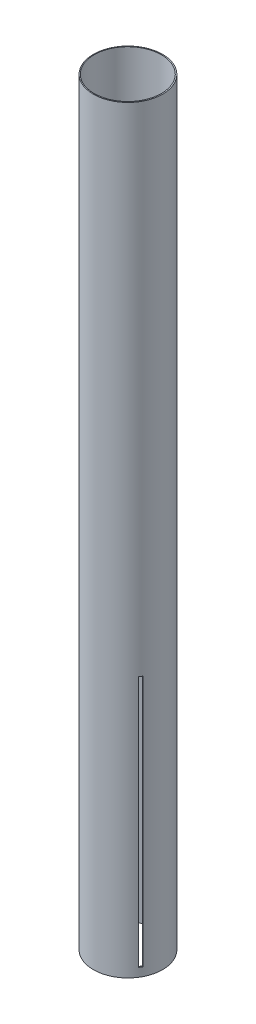
ISO-10303-21;
HEADER;
FILE_DESCRIPTION(('STEP AP214'),'2;1');
FILE_NAME('part.step','',(''),(''),'','','');
FILE_SCHEMA(('AUTOMOTIVE_DESIGN { 1 0 10303 214 1 1 1 1 }'));
ENDSEC;
DATA;
#1=APPLICATION_CONTEXT('core data for automotive mechanical design processes');
#2=APPLICATION_PROTOCOL_DEFINITION('international standard','automotive_design',2000,#1);
#3=PRODUCT_CONTEXT('',#1,'mechanical');
#4=PRODUCT('Part','Part','',(#3));
#5=PRODUCT_RELATED_PRODUCT_CATEGORY('part','',(#4));
#6=PRODUCT_DEFINITION_FORMATION('','',#4);
#7=PRODUCT_DEFINITION_CONTEXT('part definition',#1,'design');
#8=PRODUCT_DEFINITION('design','',#6,#7);
#9=PRODUCT_DEFINITION_SHAPE('','',#8);
#10=(LENGTH_UNIT() NAMED_UNIT(*) SI_UNIT(.MILLI.,.METRE.));
#11=(NAMED_UNIT(*) PLANE_ANGLE_UNIT() SI_UNIT($,.RADIAN.));
#12=(NAMED_UNIT(*) SI_UNIT($,.STERADIAN.) SOLID_ANGLE_UNIT());
#13=UNCERTAINTY_MEASURE_WITH_UNIT(LENGTH_MEASURE(1.E-05),#10,'distance_accuracy_value','');
#14=(GEOMETRIC_REPRESENTATION_CONTEXT(3) GLOBAL_UNCERTAINTY_ASSIGNED_CONTEXT((#13)) GLOBAL_UNIT_ASSIGNED_CONTEXT((#10,
#11,#12)) REPRESENTATION_CONTEXT('',''));
#15=CARTESIAN_POINT('',(0.,0.,0.));
#16=DIRECTION('',(0.,0.,1.));
#17=DIRECTION('',(1.,0.,0.));
#18=AXIS2_PLACEMENT_3D('',#15,#16,#17);
#19=CARTESIAN_POINT('',(0.,1117.6,0.));
#20=DIRECTION('',(0.,1.,0.));
#21=DIRECTION('',(0.,0.,1.));
#22=AXIS2_PLACEMENT_3D('',#19,#20,#21);
#23=PLANE('',#22);
#24=CARTESIAN_POINT('',(0.,1117.6,0.));
#25=DIRECTION('',(0.,1.,0.));
#26=DIRECTION('',(0.,0.,1.));
#27=AXIS2_PLACEMENT_3D('',#24,#25,#26);
#28=CIRCLE('',#27,51.);
#29=CARTESIAN_POINT('',(0.,1117.6,51.));
#30=VERTEX_POINT('',#29);
#31=EDGE_CURVE('E168',#30,#30,#28,.T.);
#32=ORIENTED_EDGE('',*,*,#31,.T.);
#33=EDGE_LOOP('',(#32));
#34=FACE_BOUND('',#33,.T.);
#35=CARTESIAN_POINT('',(-0.342312984914291,1117.6,0.));
#36=DIRECTION('',(0.,1.,0.));
#37=DIRECTION('',(0.,0.,1.));
#38=AXIS2_PLACEMENT_3D('',#35,#36,#37);
#39=CIRCLE('',#38,49.55);
#40=CARTESIAN_POINT('',(-0.342312984914291,1117.6,49.55));
#41=VERTEX_POINT('',#40);
#42=EDGE_CURVE('E172',#41,#41,#39,.T.);
#43=ORIENTED_EDGE('',*,*,#42,.F.);
#44=EDGE_LOOP('',(#43));
#45=FACE_BOUND('',#44,.T.);
#46=ADVANCED_FACE('F33',(#34,#45),#23,.T.);
#47=CARTESIAN_POINT('',(0.,0.,0.));
#48=DIRECTION('',(0.,1.,0.));
#49=DIRECTION('',(0.,0.,1.));
#50=AXIS2_PLACEMENT_3D('',#47,#48,#49);
#51=PLANE('',#50);
#52=CARTESIAN_POINT('',(0.,0.,0.));
#53=DIRECTION('',(0.,1.,0.));
#54=DIRECTION('',(0.,0.,1.));
#55=AXIS2_PLACEMENT_3D('',#52,#53,#54);
#56=CIRCLE('',#55,51.);
#57=CARTESIAN_POINT('',(0.,0.,51.));
#58=VERTEX_POINT('',#57);
#59=EDGE_CURVE('E169',#58,#58,#56,.T.);
#60=ORIENTED_EDGE('',*,*,#59,.F.);
#61=EDGE_LOOP('',(#60));
#62=FACE_BOUND('',#61,.T.);
#63=CARTESIAN_POINT('',(-0.342312984914291,0.,0.));
#64=DIRECTION('',(0.,1.,0.));
#65=DIRECTION('',(0.,0.,1.));
#66=AXIS2_PLACEMENT_3D('',#63,#64,#65);
#67=CIRCLE('',#66,49.55);
#68=CARTESIAN_POINT('',(-0.342312984914291,0.,49.55));
#69=VERTEX_POINT('',#68);
#70=EDGE_CURVE('E175',#69,#69,#67,.T.);
#71=ORIENTED_EDGE('',*,*,#70,.T.);
#72=EDGE_LOOP('',(#71));
#73=FACE_BOUND('',#72,.T.);
#74=ADVANCED_FACE('F239',(#62,#73),#51,.F.);
#75=CARTESIAN_POINT('',(0.,1117.6,0.));
#76=DIRECTION('',(0.,-1.,0.));
#77=DIRECTION('',(0.,0.,-1.));
#78=AXIS2_PLACEMENT_3D('',#75,#76,#77);
#79=CYLINDRICAL_SURFACE('',#78,51.);
#80=CARTESIAN_POINT('',(0.,383.7,0.));
#81=DIRECTION('',(0.,1.,0.));
#82=DIRECTION('',(0.,0.,1.));
#83=AXIS2_PLACEMENT_3D('',#80,#81,#82);
#84=CIRCLE('',#83,51.);
#85=CARTESIAN_POINT('',(-45.3091761029145,383.7,23.4110777384357));
#86=VERTEX_POINT('',#85);
#87=CARTESIAN_POINT('',(-42.9291761029145,383.7,27.5333586604496));
#88=VERTEX_POINT('',#87);
#89=EDGE_CURVE('E204',#86,#88,#84,.T.);
#90=ORIENTED_EDGE('',*,*,#89,.T.);
#91=DIRECTION('',(0.,-1.,0.));
#92=VECTOR('',#91,1.);
#93=CARTESIAN_POINT('',(-42.9291761029144,1117.6,27.5333586604497));
#94=LINE('',#93,#92);
#95=CARTESIAN_POINT('',(-42.9291761029146,12.6999999999999,27.5333586604495));
#96=VERTEX_POINT('',#95);
#97=EDGE_CURVE('E195',#88,#96,#94,.T.);
#98=ORIENTED_EDGE('',*,*,#97,.T.);
#99=CARTESIAN_POINT('',(0.,12.6999999999999,0.));
#100=DIRECTION('',(0.,-1.,0.));
#101=DIRECTION('',(0.,0.,-1.));
#102=AXIS2_PLACEMENT_3D('',#99,#100,#101);
#103=CIRCLE('',#102,51.);
#104=CARTESIAN_POINT('',(-45.3091761029146,12.6999999999999,23.4110777384356));
#105=VERTEX_POINT('',#104);
#106=EDGE_CURVE('E211',#96,#105,#103,.T.);
#107=ORIENTED_EDGE('',*,*,#106,.T.);
#108=DIRECTION('',(0.,-1.,0.));
#109=VECTOR('',#108,1.);
#110=CARTESIAN_POINT('',(-45.3091761029145,1117.6,23.4110777384358));
#111=LINE('',#110,#109);
#112=EDGE_CURVE('E207',#105,#86,#111,.F.);
#113=ORIENTED_EDGE('',*,*,#112,.T.);
#114=EDGE_LOOP('',(#90,#98,#107,#113));
#115=FACE_BOUND('',#114,.T.);
#116=CARTESIAN_POINT('',(42.9291761029151,383.7,27.5333586604487));
#117=VERTEX_POINT('',#116);
#118=CARTESIAN_POINT('',(45.309176102915,383.7,23.4110777384348));
#119=VERTEX_POINT('',#118);
#120=EDGE_CURVE('E137',#117,#119,#84,.T.);
#121=ORIENTED_EDGE('',*,*,#120,.T.);
#122=DIRECTION('',(0.,-1.,0.));
#123=VECTOR('',#122,1.);
#124=CARTESIAN_POINT('',(45.3091761029151,1117.6,23.4110777384346));
#125=LINE('',#124,#123);
#126=CARTESIAN_POINT('',(45.3091761029149,12.7,23.4110777384349));
#127=VERTEX_POINT('',#126);
#128=EDGE_CURVE('E214',#119,#127,#125,.T.);
#129=ORIENTED_EDGE('',*,*,#128,.T.);
#130=CARTESIAN_POINT('',(42.929176102915,12.7,27.5333586604488));
#131=VERTEX_POINT('',#130);
#132=EDGE_CURVE('E210',#127,#131,#103,.T.);
#133=ORIENTED_EDGE('',*,*,#132,.T.);
#134=DIRECTION('',(0.,-1.,0.));
#135=VECTOR('',#134,1.);
#136=CARTESIAN_POINT('',(42.9291761029151,1117.6,27.5333586604487));
#137=LINE('',#136,#135);
#138=EDGE_CURVE('E217',#131,#117,#137,.F.);
#139=ORIENTED_EDGE('',*,*,#138,.T.);
#140=EDGE_LOOP('',(#121,#129,#133,#139));
#141=FACE_BOUND('',#140,.T.);
#142=DIRECTION('',(0.,-1.,0.));
#143=VECTOR('',#142,1.);
#144=CARTESIAN_POINT('',(2.37999999999975,1117.6,-50.9444363988846));
#145=LINE('',#144,#143);
#146=CARTESIAN_POINT('',(2.37999999999996,12.6999999999999,-50.9444363988846));
#147=VERTEX_POINT('',#146);
#148=CARTESIAN_POINT('',(2.37999999999989,383.7,-50.9444363988846));
#149=VERTEX_POINT('',#148);
#150=EDGE_CURVE('E185',#147,#149,#145,.F.);
#151=ORIENTED_EDGE('',*,*,#150,.T.);
#152=CARTESIAN_POINT('',(0.,383.7,0.));
#153=DIRECTION('',(0.,1.,0.));
#154=DIRECTION('',(0.,0.,1.));
#155=AXIS2_PLACEMENT_3D('',#152,#153,#154);
#156=CIRCLE('',#155,51.);
#157=CARTESIAN_POINT('',(-2.38000000000011,383.7,-50.9444363988846));
#158=VERTEX_POINT('',#157);
#159=EDGE_CURVE('E183',#149,#158,#156,.T.);
#160=ORIENTED_EDGE('',*,*,#159,.T.);
#161=DIRECTION('',(0.,-1.,0.));
#162=VECTOR('',#161,1.);
#163=CARTESIAN_POINT('',(-2.38000000000034,1117.6,-50.9444363988846));
#164=LINE('',#163,#162);
#165=CARTESIAN_POINT('',(-2.38,12.6999999999999,-50.9444363988846));
#166=VERTEX_POINT('',#165);
#167=EDGE_CURVE('E178',#158,#166,#164,.T.);
#168=ORIENTED_EDGE('',*,*,#167,.T.);
#169=CARTESIAN_POINT('',(0.,12.6999999999999,0.));
#170=DIRECTION('',(0.,-1.,0.));
#171=DIRECTION('',(0.,0.,-1.));
#172=AXIS2_PLACEMENT_3D('',#169,#170,#171);
#173=CIRCLE('',#172,51.);
#174=EDGE_CURVE('E188',#166,#147,#173,.T.);
#175=ORIENTED_EDGE('',*,*,#174,.T.);
#176=EDGE_LOOP('',(#151,#160,#168,#175));
#177=FACE_BOUND('',#176,.T.);
#178=ORIENTED_EDGE('',*,*,#31,.F.);
#179=EDGE_LOOP('',(#178));
#180=FACE_BOUND('',#179,.T.);
#181=ORIENTED_EDGE('',*,*,#59,.T.);
#182=EDGE_LOOP('',(#181));
#183=FACE_BOUND('',#182,.T.);
#184=ADVANCED_FACE('F35',(#115,#141,#177,#180,#183),#79,.T.);
#185=CARTESIAN_POINT('',(-0.342312984914291,1117.6,0.));
#186=DIRECTION('',(0.,-1.,0.));
#187=DIRECTION('',(0.,0.,-1.));
#188=AXIS2_PLACEMENT_3D('',#185,#186,#187);
#189=CYLINDRICAL_SURFACE('',#188,49.55);
#190=DIRECTION('',(0.,-1.,0.));
#191=VECTOR('',#190,1.);
#192=CARTESIAN_POINT('',(-41.9213794742709,1117.6,26.951507005614));
#193=LINE('',#192,#191);
#194=CARTESIAN_POINT('',(-41.921379474271,383.7,26.9515070056138));
#195=VERTEX_POINT('',#194);
#196=CARTESIAN_POINT('',(-41.9213794742711,12.6999999999999,26.9515070056137));
#197=VERTEX_POINT('',#196);
#198=EDGE_CURVE('E11',#195,#197,#193,.T.);
#199=ORIENTED_EDGE('',*,*,#198,.F.);
#200=CARTESIAN_POINT('',(-0.342312984914291,383.7,0.));
#201=DIRECTION('',(0.,1.,0.));
#202=DIRECTION('',(0.,0.,1.));
#203=AXIS2_PLACEMENT_3D('',#200,#201,#202);
#204=CIRCLE('',#203,49.55);
#205=CARTESIAN_POINT('',(-44.315635270066,383.7,22.8374566711397));
#206=VERTEX_POINT('',#205);
#207=EDGE_CURVE('E41',#206,#195,#204,.T.);
#208=ORIENTED_EDGE('',*,*,#207,.F.);
#209=DIRECTION('',(0.,-1.,0.));
#210=VECTOR('',#209,1.);
#211=CARTESIAN_POINT('',(-44.3156352700659,1117.6,22.8374566711398));
#212=LINE('',#211,#210);
#213=CARTESIAN_POINT('',(-44.315635270066,12.6999999999999,22.8374566711396));
#214=VERTEX_POINT('',#213);
#215=EDGE_CURVE('E149',#214,#206,#212,.F.);
#216=ORIENTED_EDGE('',*,*,#215,.F.);
#217=CARTESIAN_POINT('',(-0.342312984914291,12.6999999999999,0.));
#218=DIRECTION('',(0.,-1.,0.));
#219=DIRECTION('',(0.,0.,-1.));
#220=AXIS2_PLACEMENT_3D('',#217,#218,#219);
#221=CIRCLE('',#220,49.55);
#222=EDGE_CURVE('E146',#197,#214,#221,.T.);
#223=ORIENTED_EDGE('',*,*,#222,.F.);
#224=EDGE_LOOP('',(#199,#208,#216,#223));
#225=FACE_BOUND('',#224,.T.);
#226=DIRECTION('',(0.,-1.,0.));
#227=VECTOR('',#226,1.);
#228=CARTESIAN_POINT('',(43.7879099969001,1117.6,22.5327743426179));
#229=LINE('',#228,#227);
#230=CARTESIAN_POINT('',(43.7879099969,383.7,22.5327743426181));
#231=VERTEX_POINT('',#230);
#232=CARTESIAN_POINT('',(43.7879099969,12.7,22.5327743426182));
#233=VERTEX_POINT('',#232);
#234=EDGE_CURVE('E144',#231,#233,#229,.T.);
#235=ORIENTED_EDGE('',*,*,#234,.F.);
#236=CARTESIAN_POINT('',(41.422165792695,383.7,26.6632858521717));
#237=VERTEX_POINT('',#236);
#238=EDGE_CURVE('E134',#237,#231,#204,.T.);
#239=ORIENTED_EDGE('',*,*,#238,.F.);
#240=DIRECTION('',(0.,-1.,0.));
#241=VECTOR('',#240,1.);
#242=CARTESIAN_POINT('',(41.4221657926951,1117.6,26.6632858521716));
#243=LINE('',#242,#241);
#244=CARTESIAN_POINT('',(41.4221657926951,12.6999999999999,26.6632858521716));
#245=VERTEX_POINT('',#244);
#246=EDGE_CURVE('E120',#245,#237,#243,.F.);
#247=ORIENTED_EDGE('',*,*,#246,.F.);
#248=EDGE_CURVE('E128',#233,#245,#221,.T.);
#249=ORIENTED_EDGE('',*,*,#248,.F.);
#250=EDGE_LOOP('',(#235,#239,#247,#249));
#251=FACE_BOUND('',#250,.T.);
#252=DIRECTION('',(0.,-1.,0.));
#253=VECTOR('',#252,1.);
#254=CARTESIAN_POINT('',(-2.38000000000034,1117.6,-49.5080834978345));
#255=LINE('',#254,#253);
#256=CARTESIAN_POINT('',(-2.38000000000011,383.7,-49.5080834978345));
#257=VERTEX_POINT('',#256);
#258=CARTESIAN_POINT('',(-2.38,12.6999999999999,-49.5080834978345));
#259=VERTEX_POINT('',#258);
#260=EDGE_CURVE('E129',#257,#259,#255,.T.);
#261=ORIENTED_EDGE('',*,*,#260,.F.);
#262=CARTESIAN_POINT('',(-0.342312984914291,383.7,0.));
#263=DIRECTION('',(0.,1.,0.));
#264=DIRECTION('',(0.,0.,1.));
#265=AXIS2_PLACEMENT_3D('',#262,#263,#264);
#266=CIRCLE('',#265,49.55);
#267=CARTESIAN_POINT('',(2.37999999999989,383.7,-49.4751605556987));
#268=VERTEX_POINT('',#267);
#269=EDGE_CURVE('E162',#268,#257,#266,.T.);
#270=ORIENTED_EDGE('',*,*,#269,.F.);
#271=DIRECTION('',(0.,-1.,0.));
#272=VECTOR('',#271,1.);
#273=CARTESIAN_POINT('',(2.37999999999975,1117.6,-49.4751605556987));
#274=LINE('',#273,#272);
#275=CARTESIAN_POINT('',(2.37999999999996,12.6999999999999,-49.4751605556987));
#276=VERTEX_POINT('',#275);
#277=EDGE_CURVE('E164',#276,#268,#274,.F.);
#278=ORIENTED_EDGE('',*,*,#277,.F.);
#279=CARTESIAN_POINT('',(-0.342312984914291,12.6999999999999,0.));
#280=DIRECTION('',(0.,-1.,0.));
#281=DIRECTION('',(0.,0.,-1.));
#282=AXIS2_PLACEMENT_3D('',#279,#280,#281);
#283=CIRCLE('',#282,49.55);
#284=EDGE_CURVE('E166',#259,#276,#283,.T.);
#285=ORIENTED_EDGE('',*,*,#284,.F.);
#286=EDGE_LOOP('',(#261,#270,#278,#285));
#287=FACE_BOUND('',#286,.T.);
#288=ORIENTED_EDGE('',*,*,#42,.T.);
#289=EDGE_LOOP('',(#288));
#290=FACE_BOUND('',#289,.T.);
#291=ORIENTED_EDGE('',*,*,#70,.F.);
#292=EDGE_LOOP('',(#291));
#293=FACE_BOUND('',#292,.T.);
#294=ADVANCED_FACE('F142',(#225,#251,#287,#290,#293),#189,.F.);
#295=CARTESIAN_POINT('',(-2.38000000000011,383.7,-51.));
#296=DIRECTION('',(-1.,0.,0.));
#297=DIRECTION('',(0.,-1.,0.));
#298=AXIS2_PLACEMENT_3D('',#295,#296,#297);
#299=PLANE('',#298);
#300=DIRECTION('',(0.,0.,1.));
#301=VECTOR('',#300,1.);
#302=CARTESIAN_POINT('',(-2.38000000000011,383.7,-51.));
#303=LINE('',#302,#301);
#304=EDGE_CURVE('E198',#158,#257,#303,.T.);
#305=ORIENTED_EDGE('',*,*,#304,.T.);
#306=ORIENTED_EDGE('',*,*,#260,.T.);
#307=DIRECTION('',(0.,0.,1.));
#308=VECTOR('',#307,1.);
#309=CARTESIAN_POINT('',(-2.38,12.7,-51.));
#310=LINE('',#309,#308);
#311=EDGE_CURVE('E190',#166,#259,#310,.T.);
#312=ORIENTED_EDGE('',*,*,#311,.F.);
#313=ORIENTED_EDGE('',*,*,#167,.F.);
#314=EDGE_LOOP('',(#305,#306,#312,#313));
#315=FACE_BOUND('',#314,.T.);
#316=ADVANCED_FACE('F252',(#315),#299,.F.);
#317=CARTESIAN_POINT('',(2.37999999999989,383.7,-51.));
#318=DIRECTION('',(0.,1.,0.));
#319=DIRECTION('',(0.,0.,1.));
#320=AXIS2_PLACEMENT_3D('',#317,#318,#319);
#321=PLANE('',#320);
#322=DIRECTION('',(0.,0.,1.));
#323=VECTOR('',#322,1.);
#324=CARTESIAN_POINT('',(2.37999999999989,383.7,-51.));
#325=LINE('',#324,#323);
#326=EDGE_CURVE('E194',#149,#268,#325,.T.);
#327=ORIENTED_EDGE('',*,*,#326,.T.);
#328=ORIENTED_EDGE('',*,*,#269,.T.);
#329=ORIENTED_EDGE('',*,*,#304,.F.);
#330=ORIENTED_EDGE('',*,*,#159,.F.);
#331=EDGE_LOOP('',(#327,#328,#329,#330));
#332=FACE_BOUND('',#331,.T.);
#333=ADVANCED_FACE('F258',(#332),#321,.F.);
#334=CARTESIAN_POINT('',(2.37999999999996,12.7,-51.));
#335=DIRECTION('',(1.,0.,0.));
#336=DIRECTION('',(0.,1.,0.));
#337=AXIS2_PLACEMENT_3D('',#334,#335,#336);
#338=PLANE('',#337);
#339=DIRECTION('',(0.,0.,1.));
#340=VECTOR('',#339,1.);
#341=CARTESIAN_POINT('',(2.37999999999996,12.7,-51.));
#342=LINE('',#341,#340);
#343=EDGE_CURVE('E191',#147,#276,#342,.T.);
#344=ORIENTED_EDGE('',*,*,#343,.T.);
#345=ORIENTED_EDGE('',*,*,#277,.T.);
#346=ORIENTED_EDGE('',*,*,#326,.F.);
#347=ORIENTED_EDGE('',*,*,#150,.F.);
#348=EDGE_LOOP('',(#344,#345,#346,#347));
#349=FACE_BOUND('',#348,.T.);
#350=ADVANCED_FACE('F378',(#349),#338,.F.);
#351=CARTESIAN_POINT('',(0.,12.7,-51.));
#352=DIRECTION('',(0.,-1.,0.));
#353=DIRECTION('',(0.,0.,-1.));
#354=AXIS2_PLACEMENT_3D('',#351,#352,#353);
#355=PLANE('',#354);
#356=ORIENTED_EDGE('',*,*,#174,.F.);
#357=ORIENTED_EDGE('',*,*,#311,.T.);
#358=ORIENTED_EDGE('',*,*,#284,.T.);
#359=ORIENTED_EDGE('',*,*,#343,.F.);
#360=EDGE_LOOP('',(#356,#357,#358,#359));
#361=FACE_BOUND('',#360,.T.);
#362=ADVANCED_FACE('F286',(#361),#355,.F.);
#363=CARTESIAN_POINT('',(59.1436477965034,12.7,36.8947882575095));
#364=DIRECTION('',(-0.499999999999992,0.,0.866025403784443));
#365=DIRECTION('',(0.866025403784443,0.,0.499999999999992));
#366=AXIS2_PLACEMENT_3D('',#363,#364,#365);
#367=PLANE('',#366);
#368=DIRECTION('',(-0.866025403784443,0.,-0.499999999999992));
#369=VECTOR('',#368,1.);
#370=CARTESIAN_POINT('',(59.1436477965034,12.7,36.8947882575095));
#371=LINE('',#370,#369);
#372=EDGE_CURVE('E123',#131,#245,#371,.T.);
#373=ORIENTED_EDGE('',*,*,#372,.T.);
#374=ORIENTED_EDGE('',*,*,#246,.T.);
#375=DIRECTION('',(-0.866025403784443,0.,-0.499999999999992));
#376=VECTOR('',#375,1.);
#377=CARTESIAN_POINT('',(59.1436477965034,383.7,36.8947882575094));
#378=LINE('',#377,#376);
#379=EDGE_CURVE('E56',#117,#237,#378,.T.);
#380=ORIENTED_EDGE('',*,*,#379,.F.);
#381=ORIENTED_EDGE('',*,*,#138,.F.);
#382=EDGE_LOOP('',(#373,#374,#380,#381));
#383=FACE_BOUND('',#382,.T.);
#384=ADVANCED_FACE('F121',(#383),#367,.F.);
#385=CARTESIAN_POINT('',(61.5236477965034,383.7,32.7725073354955));
#386=DIRECTION('',(0.499999999999992,0.,-0.866025403784443));
#387=DIRECTION('',(-0.866025403784443,0.,-0.499999999999992));
#388=AXIS2_PLACEMENT_3D('',#385,#386,#387);
#389=PLANE('',#388);
#390=DIRECTION('',(-0.866025403784443,0.,-0.499999999999992));
#391=VECTOR('',#390,1.);
#392=CARTESIAN_POINT('',(61.5236477965034,383.7,32.7725073354955));
#393=LINE('',#392,#391);
#394=EDGE_CURVE('E139',#119,#231,#393,.T.);
#395=ORIENTED_EDGE('',*,*,#394,.T.);
#396=ORIENTED_EDGE('',*,*,#234,.T.);
#397=DIRECTION('',(-0.866025403784443,0.,-0.499999999999992));
#398=VECTOR('',#397,1.);
#399=CARTESIAN_POINT('',(61.5236477965033,12.7,32.7725073354956));
#400=LINE('',#399,#398);
#401=EDGE_CURVE('E222',#127,#233,#400,.T.);
#402=ORIENTED_EDGE('',*,*,#401,.F.);
#403=ORIENTED_EDGE('',*,*,#128,.F.);
#404=EDGE_LOOP('',(#395,#396,#402,#403));
#405=FACE_BOUND('',#404,.T.);
#406=ADVANCED_FACE('F235',(#405),#389,.F.);
#407=CARTESIAN_POINT('',(-60.3336477965031,12.7,34.8336477965035));
#408=DIRECTION('',(0.,-1.,0.));
#409=DIRECTION('',(0.,0.,-1.));
#410=AXIS2_PLACEMENT_3D('',#407,#408,#409);
#411=PLANE('',#410);
#412=ORIENTED_EDGE('',*,*,#401,.T.);
#413=ORIENTED_EDGE('',*,*,#248,.T.);
#414=ORIENTED_EDGE('',*,*,#372,.F.);
#415=ORIENTED_EDGE('',*,*,#132,.F.);
#416=EDGE_LOOP('',(#412,#413,#414,#415));
#417=FACE_BOUND('',#416,.T.);
#418=ADVANCED_FACE('F232',(#417),#411,.F.);
#419=CARTESIAN_POINT('',(-61.523647796503,383.7,32.7725073354966));
#420=DIRECTION('',(0.,1.,0.));
#421=DIRECTION('',(0.,0.,1.));
#422=AXIS2_PLACEMENT_3D('',#419,#420,#421);
#423=PLANE('',#422);
#424=ORIENTED_EDGE('',*,*,#379,.T.);
#425=ORIENTED_EDGE('',*,*,#238,.T.);
#426=ORIENTED_EDGE('',*,*,#394,.F.);
#427=ORIENTED_EDGE('',*,*,#120,.F.);
#428=EDGE_LOOP('',(#424,#425,#426,#427));
#429=FACE_BOUND('',#428,.T.);
#430=ADVANCED_FACE('F132',(#429),#423,.F.);
#431=CARTESIAN_POINT('',(-59.143647796503,383.7,36.8947882575106));
#432=DIRECTION('',(0.500000000000004,0.,0.866025403784436));
#433=DIRECTION('',(0.866025403784436,0.,-0.500000000000004));
#434=AXIS2_PLACEMENT_3D('',#431,#432,#433);
#435=PLANE('',#434);
#436=DIRECTION('',(0.866025403784436,0.,-0.500000000000004));
#437=VECTOR('',#436,1.);
#438=CARTESIAN_POINT('',(-59.143647796503,383.7,36.8947882575106));
#439=LINE('',#438,#437);
#440=EDGE_CURVE('E224',#88,#195,#439,.T.);
#441=ORIENTED_EDGE('',*,*,#440,.T.);
#442=ORIENTED_EDGE('',*,*,#198,.T.);
#443=DIRECTION('',(0.866025403784436,0.,-0.500000000000004));
#444=VECTOR('',#443,1.);
#445=CARTESIAN_POINT('',(-59.1436477965031,12.7,36.8947882575105));
#446=LINE('',#445,#444);
#447=EDGE_CURVE('E219',#96,#197,#446,.T.);
#448=ORIENTED_EDGE('',*,*,#447,.F.);
#449=ORIENTED_EDGE('',*,*,#97,.F.);
#450=EDGE_LOOP('',(#441,#442,#448,#449));
#451=FACE_BOUND('',#450,.T.);
#452=ADVANCED_FACE('F328',(#451),#435,.F.);
#453=DIRECTION('',(0.866025403784436,0.,-0.500000000000004));
#454=VECTOR('',#453,1.);
#455=CARTESIAN_POINT('',(-61.523647796503,383.7,32.7725073354966));
#456=LINE('',#455,#454);
#457=EDGE_CURVE('E221',#86,#206,#456,.T.);
#458=ORIENTED_EDGE('',*,*,#457,.T.);
#459=ORIENTED_EDGE('',*,*,#207,.T.);
#460=ORIENTED_EDGE('',*,*,#440,.F.);
#461=ORIENTED_EDGE('',*,*,#89,.F.);
#462=EDGE_LOOP('',(#458,#459,#460,#461));
#463=FACE_BOUND('',#462,.T.);
#464=ADVANCED_FACE('F330',(#463),#423,.F.);
#465=CARTESIAN_POINT('',(-61.5236477965031,12.7,32.7725073354966));
#466=DIRECTION('',(-0.500000000000004,0.,-0.866025403784436));
#467=DIRECTION('',(-0.866025403784436,0.,0.500000000000004));
#468=AXIS2_PLACEMENT_3D('',#465,#466,#467);
#469=PLANE('',#468);
#470=DIRECTION('',(0.866025403784436,0.,-0.500000000000004));
#471=VECTOR('',#470,1.);
#472=CARTESIAN_POINT('',(-61.5236477965031,12.7,32.7725073354966));
#473=LINE('',#472,#471);
#474=EDGE_CURVE('E48',#105,#214,#473,.T.);
#475=ORIENTED_EDGE('',*,*,#474,.T.);
#476=ORIENTED_EDGE('',*,*,#215,.T.);
#477=ORIENTED_EDGE('',*,*,#457,.F.);
#478=ORIENTED_EDGE('',*,*,#112,.F.);
#479=EDGE_LOOP('',(#475,#476,#477,#478));
#480=FACE_BOUND('',#479,.T.);
#481=ADVANCED_FACE('F348',(#480),#469,.F.);
#482=ORIENTED_EDGE('',*,*,#447,.T.);
#483=ORIENTED_EDGE('',*,*,#222,.T.);
#484=ORIENTED_EDGE('',*,*,#474,.F.);
#485=ORIENTED_EDGE('',*,*,#106,.F.);
#486=EDGE_LOOP('',(#482,#483,#484,#485));
#487=FACE_BOUND('',#486,.T.);
#488=ADVANCED_FACE('F318',(#487),#411,.F.);
#489=CLOSED_SHELL('',(#46,#74,#184,#294,#316,#333,#350,#362,#384,#406,#418,#430,#452,#464,#481,#488));
#490=MANIFOLD_SOLID_BREP('B2',#489);
#491=ADVANCED_BREP_SHAPE_REPRESENTATION('',(#18,#490),#14);
#492=SHAPE_DEFINITION_REPRESENTATION(#9,#491);
ENDSEC;
END-ISO-10303-21;
